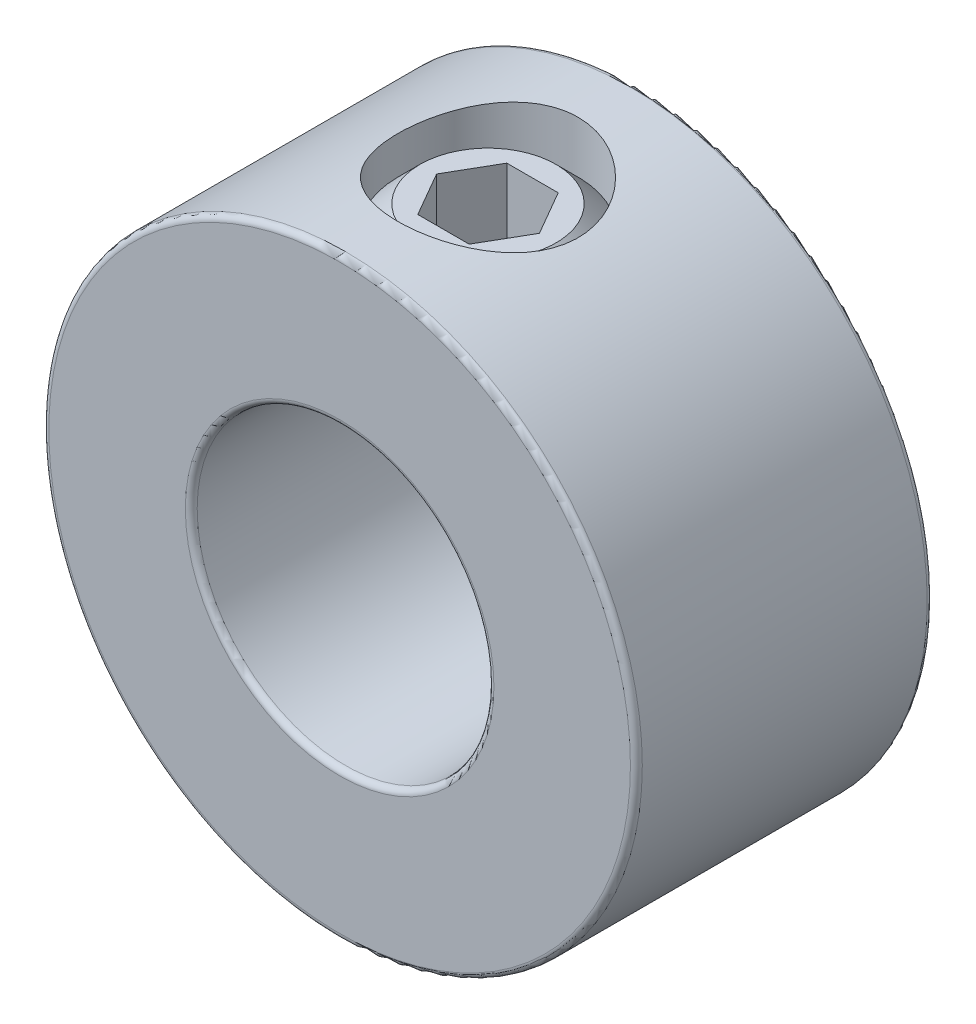
ISO-10303-21;
HEADER;
FILE_DESCRIPTION(('STEP AP214'),'2;1');
FILE_NAME('part.step','',(''),(''),'','','');
FILE_SCHEMA(('AUTOMOTIVE_DESIGN { 1 0 10303 214 1 1 1 1 }'));
ENDSEC;
DATA;
#1=APPLICATION_CONTEXT('core data for automotive mechanical design processes');
#2=APPLICATION_PROTOCOL_DEFINITION('international standard','automotive_design',2000,#1);
#3=PRODUCT_CONTEXT('',#1,'mechanical');
#4=PRODUCT('Part','Part','',(#3));
#5=PRODUCT_RELATED_PRODUCT_CATEGORY('part','',(#4));
#6=PRODUCT_DEFINITION_FORMATION('','',#4);
#7=PRODUCT_DEFINITION_CONTEXT('part definition',#1,'design');
#8=PRODUCT_DEFINITION('design','',#6,#7);
#9=PRODUCT_DEFINITION_SHAPE('','',#8);
#10=(LENGTH_UNIT() NAMED_UNIT(*) SI_UNIT(.MILLI.,.METRE.));
#11=(NAMED_UNIT(*) PLANE_ANGLE_UNIT() SI_UNIT($,.RADIAN.));
#12=(NAMED_UNIT(*) SI_UNIT($,.STERADIAN.) SOLID_ANGLE_UNIT());
#13=UNCERTAINTY_MEASURE_WITH_UNIT(LENGTH_MEASURE(1.E-05),#10,'distance_accuracy_value','');
#14=(GEOMETRIC_REPRESENTATION_CONTEXT(3) GLOBAL_UNCERTAINTY_ASSIGNED_CONTEXT((#13)) GLOBAL_UNIT_ASSIGNED_CONTEXT((#10,
#11,#12)) REPRESENTATION_CONTEXT('',''));
#15=CARTESIAN_POINT('',(0.,0.,0.));
#16=DIRECTION('',(0.,0.,1.));
#17=DIRECTION('',(1.,0.,0.));
#18=AXIS2_PLACEMENT_3D('',#15,#16,#17);
#19=CARTESIAN_POINT('',(0.,7.14375,0.));
#20=DIRECTION('',(0.,1.,0.));
#21=DIRECTION('',(-1.,0.,0.));
#22=AXIS2_PLACEMENT_3D('',#19,#20,#21);
#23=PLANE('',#22);
#24=CARTESIAN_POINT('',(0.,7.14375,0.));
#25=DIRECTION('',(0.,1.,0.));
#26=DIRECTION('',(-1.,0.,0.));
#27=AXIS2_PLACEMENT_3D('',#24,#25,#26);
#28=CIRCLE('',#27,1.81975161629017);
#29=CARTESIAN_POINT('',(-1.81975161629017,7.14375,0.));
#30=VERTEX_POINT('',#29);
#31=EDGE_CURVE('E12',#30,#30,#28,.T.);
#32=ORIENTED_EDGE('',*,*,#31,.T.);
#33=EDGE_LOOP('',(#32));
#34=FACE_BOUND('',#33,.T.);
#35=DIRECTION('',(1.,0.,0.));
#36=VECTOR('',#35,1.);
#37=CARTESIAN_POINT('',(-0.687407664253898,7.14374999999999,-1.190625));
#38=LINE('',#37,#36);
#39=CARTESIAN_POINT('',(-0.687407664253898,7.14374999999999,-1.190625));
#40=VERTEX_POINT('',#39);
#41=CARTESIAN_POINT('',(0.687407664253898,7.14375,-1.190625));
#42=VERTEX_POINT('',#41);
#43=EDGE_CURVE('E110',#40,#42,#38,.T.);
#44=ORIENTED_EDGE('',*,*,#43,.T.);
#45=DIRECTION('',(0.5,0.,0.866025403784439));
#46=VECTOR('',#45,1.);
#47=CARTESIAN_POINT('',(0.687407664253898,7.14374999999999,-1.190625));
#48=LINE('',#47,#46);
#49=CARTESIAN_POINT('',(1.3748153285078,7.14374999999999,0.));
#50=VERTEX_POINT('',#49);
#51=EDGE_CURVE('E56',#42,#50,#48,.T.);
#52=ORIENTED_EDGE('',*,*,#51,.T.);
#53=DIRECTION('',(-0.5,0.,0.866025403784439));
#54=VECTOR('',#53,1.);
#55=CARTESIAN_POINT('',(1.3748153285078,7.14374999999999,0.));
#56=LINE('',#55,#54);
#57=CARTESIAN_POINT('',(0.687407664253899,7.14374999999999,1.190625));
#58=VERTEX_POINT('',#57);
#59=EDGE_CURVE('E114',#50,#58,#56,.T.);
#60=ORIENTED_EDGE('',*,*,#59,.T.);
#61=DIRECTION('',(-1.,0.,0.));
#62=VECTOR('',#61,1.);
#63=CARTESIAN_POINT('',(0.687407664253899,7.14374999999999,1.190625));
#64=LINE('',#63,#62);
#65=CARTESIAN_POINT('',(-0.687407664253899,7.14374999999999,1.190625));
#66=VERTEX_POINT('',#65);
#67=EDGE_CURVE('E177',#58,#66,#64,.T.);
#68=ORIENTED_EDGE('',*,*,#67,.T.);
#69=DIRECTION('',(-0.5,0.,-0.866025403784439));
#70=VECTOR('',#69,1.);
#71=CARTESIAN_POINT('',(-0.687407664253899,7.14374999999999,1.190625));
#72=LINE('',#71,#70);
#73=CARTESIAN_POINT('',(-1.3748153285078,7.14374999999999,0.));
#74=VERTEX_POINT('',#73);
#75=EDGE_CURVE('E162',#66,#74,#72,.T.);
#76=ORIENTED_EDGE('',*,*,#75,.T.);
#77=DIRECTION('',(0.5,0.,-0.866025403784439));
#78=VECTOR('',#77,1.);
#79=CARTESIAN_POINT('',(-1.3748153285078,7.14374999999999,0.));
#80=LINE('',#79,#78);
#81=EDGE_CURVE('E158',#74,#40,#80,.T.);
#82=ORIENTED_EDGE('',*,*,#81,.T.);
#83=EDGE_LOOP('',(#44,#52,#60,#68,#76,#82));
#84=FACE_BOUND('',#83,.T.);
#85=ADVANCED_FACE('F42',(#34,#84),#23,.T.);
#86=CARTESIAN_POINT('',(0.,7.14375,0.));
#87=DIRECTION('',(0.,-1.,0.));
#88=DIRECTION('',(1.,0.,0.));
#89=AXIS2_PLACEMENT_3D('',#86,#87,#88);
#90=CONICAL_SURFACE('',#89,1.81975161629017,0.785398163397448);
#91=CARTESIAN_POINT('',(0.,6.55050161629017,0.));
#92=DIRECTION('',(0.,1.,0.));
#93=DIRECTION('',(-1.,0.,0.));
#94=AXIS2_PLACEMENT_3D('',#91,#92,#93);
#95=CIRCLE('',#94,2.413);
#96=CARTESIAN_POINT('',(-2.413,6.55050161629017,0.));
#97=VERTEX_POINT('',#96);
#98=EDGE_CURVE('E49',#97,#97,#95,.T.);
#99=ORIENTED_EDGE('',*,*,#98,.T.);
#100=EDGE_LOOP('',(#99));
#101=FACE_BOUND('',#100,.T.);
#102=ORIENTED_EDGE('',*,*,#31,.F.);
#103=EDGE_LOOP('',(#102));
#104=FACE_BOUND('',#103,.T.);
#105=ADVANCED_FACE('F132',(#101,#104),#90,.T.);
#106=CARTESIAN_POINT('',(0.,3.96875,0.));
#107=DIRECTION('',(0.,1.,0.));
#108=DIRECTION('',(-1.,0.,0.));
#109=AXIS2_PLACEMENT_3D('',#106,#107,#108);
#110=CYLINDRICAL_SURFACE('',#109,2.413);
#111=CARTESIAN_POINT('',(0.,4.56199838370983,0.));
#112=DIRECTION('',(0.,1.,0.));
#113=DIRECTION('',(-1.,0.,0.));
#114=AXIS2_PLACEMENT_3D('',#111,#112,#113);
#115=CIRCLE('',#114,2.413);
#116=CARTESIAN_POINT('',(-2.413,4.56199838370983,0.));
#117=VERTEX_POINT('',#116);
#118=EDGE_CURVE('E127',#117,#117,#115,.T.);
#119=ORIENTED_EDGE('',*,*,#118,.T.);
#120=EDGE_LOOP('',(#119));
#121=FACE_BOUND('',#120,.T.);
#122=ORIENTED_EDGE('',*,*,#98,.F.);
#123=EDGE_LOOP('',(#122));
#124=FACE_BOUND('',#123,.T.);
#125=ADVANCED_FACE('F135',(#121,#124),#110,.T.);
#126=CARTESIAN_POINT('',(0.,4.56199838370983,0.));
#127=DIRECTION('',(0.,1.,0.));
#128=DIRECTION('',(-1.,0.,0.));
#129=AXIS2_PLACEMENT_3D('',#126,#127,#128);
#130=CONICAL_SURFACE('',#129,2.413,0.785398163397448);
#131=CARTESIAN_POINT('',(0.,3.96875,0.));
#132=DIRECTION('',(0.,1.,0.));
#133=DIRECTION('',(-1.,0.,0.));
#134=AXIS2_PLACEMENT_3D('',#131,#132,#133);
#135=CIRCLE('',#134,1.81975161629017);
#136=CARTESIAN_POINT('',(-1.81975161629017,3.96875,0.));
#137=VERTEX_POINT('',#136);
#138=EDGE_CURVE('E119',#137,#137,#135,.T.);
#139=ORIENTED_EDGE('',*,*,#138,.T.);
#140=EDGE_LOOP('',(#139));
#141=FACE_BOUND('',#140,.T.);
#142=ORIENTED_EDGE('',*,*,#118,.F.);
#143=EDGE_LOOP('',(#142));
#144=FACE_BOUND('',#143,.T.);
#145=ADVANCED_FACE('F137',(#141,#144),#130,.T.);
#146=CARTESIAN_POINT('',(-1.81975161629017,3.96875,0.));
#147=DIRECTION('',(0.,-1.,0.));
#148=DIRECTION('',(1.,0.,0.));
#149=AXIS2_PLACEMENT_3D('',#146,#147,#148);
#150=PLANE('',#149);
#151=CARTESIAN_POINT('',(0.,3.96875,0.));
#152=DIRECTION('',(0.,1.,0.));
#153=DIRECTION('',(-1.,0.,0.));
#154=AXIS2_PLACEMENT_3D('',#151,#152,#153);
#155=CIRCLE('',#154,0.711898060451797);
#156=CARTESIAN_POINT('',(-0.711898060451796,3.96875,0.));
#157=VERTEX_POINT('',#156);
#158=EDGE_CURVE('E115',#157,#157,#155,.T.);
#159=ORIENTED_EDGE('',*,*,#158,.T.);
#160=EDGE_LOOP('',(#159));
#161=FACE_BOUND('',#160,.T.);
#162=ORIENTED_EDGE('',*,*,#138,.F.);
#163=EDGE_LOOP('',(#162));
#164=FACE_BOUND('',#163,.T.);
#165=ADVANCED_FACE('F144',(#161,#164),#150,.T.);
#166=CARTESIAN_POINT('',(0.,3.96875,0.));
#167=DIRECTION('',(0.,-1.,0.));
#168=DIRECTION('',(1.,0.,0.));
#169=AXIS2_PLACEMENT_3D('',#166,#167,#168);
#170=CONICAL_SURFACE('',#169,0.711898060451797,0.785398163397448);
#171=CARTESIAN_POINT('',(0.,4.6806480604518,0.));
#172=VERTEX_POINT('',#171);
#173=VERTEX_LOOP('',#172);
#174=FACE_BOUND('',#173,.T.);
#175=ORIENTED_EDGE('',*,*,#158,.F.);
#176=EDGE_LOOP('',(#175));
#177=FACE_BOUND('',#176,.T.);
#178=ADVANCED_FACE('F211',(#174,#177),#170,.F.);
#179=CARTESIAN_POINT('',(0.687407664253898,4.76249999999999,-1.190625));
#180=DIRECTION('',(-0.866025403784439,0.,0.5));
#181=DIRECTION('',(0.5,0.,0.866025403784438));
#182=AXIS2_PLACEMENT_3D('',#179,#180,#181);
#183=PLANE('',#182);
#184=ORIENTED_EDGE('',*,*,#51,.F.);
#185=DIRECTION('',(0.,1.,0.));
#186=VECTOR('',#185,1.);
#187=CARTESIAN_POINT('',(0.687407664253898,4.76249999999999,-1.190625));
#188=LINE('',#187,#186);
#189=CARTESIAN_POINT('',(0.687407664253898,4.76249999999999,-1.190625));
#190=VERTEX_POINT('',#189);
#191=EDGE_CURVE('E109',#190,#42,#188,.T.);
#192=ORIENTED_EDGE('',*,*,#191,.F.);
#193=DIRECTION('',(0.5,0.,0.866025403784439));
#194=VECTOR('',#193,1.);
#195=CARTESIAN_POINT('',(0.687407664253898,4.76249999999999,-1.190625));
#196=LINE('',#195,#194);
#197=CARTESIAN_POINT('',(1.3748153285078,4.76249999999999,0.));
#198=VERTEX_POINT('',#197);
#199=EDGE_CURVE('E100',#190,#198,#196,.T.);
#200=ORIENTED_EDGE('',*,*,#199,.T.);
#201=DIRECTION('',(0.,1.,0.));
#202=VECTOR('',#201,1.);
#203=CARTESIAN_POINT('',(1.3748153285078,4.76249999999999,0.));
#204=LINE('',#203,#202);
#205=EDGE_CURVE('E108',#198,#50,#204,.T.);
#206=ORIENTED_EDGE('',*,*,#205,.T.);
#207=EDGE_LOOP('',(#184,#192,#200,#206));
#208=FACE_BOUND('',#207,.T.);
#209=ADVANCED_FACE('F107',(#208),#183,.T.);
#210=CARTESIAN_POINT('',(1.3748153285078,4.76249999999999,0.));
#211=DIRECTION('',(-0.866025403784439,0.,-0.5));
#212=DIRECTION('',(-0.5,0.,0.866025403784439));
#213=AXIS2_PLACEMENT_3D('',#210,#211,#212);
#214=PLANE('',#213);
#215=ORIENTED_EDGE('',*,*,#59,.F.);
#216=ORIENTED_EDGE('',*,*,#205,.F.);
#217=DIRECTION('',(-0.5,0.,0.866025403784439));
#218=VECTOR('',#217,1.);
#219=CARTESIAN_POINT('',(1.3748153285078,4.76249999999999,0.));
#220=LINE('',#219,#218);
#221=CARTESIAN_POINT('',(0.687407664253899,4.76249999999999,1.190625));
#222=VERTEX_POINT('',#221);
#223=EDGE_CURVE('E96',#198,#222,#220,.T.);
#224=ORIENTED_EDGE('',*,*,#223,.T.);
#225=DIRECTION('',(0.,1.,0.));
#226=VECTOR('',#225,1.);
#227=CARTESIAN_POINT('',(0.687407664253899,4.76249999999999,1.190625));
#228=LINE('',#227,#226);
#229=EDGE_CURVE('E116',#222,#58,#228,.T.);
#230=ORIENTED_EDGE('',*,*,#229,.T.);
#231=EDGE_LOOP('',(#215,#216,#224,#230));
#232=FACE_BOUND('',#231,.T.);
#233=ADVANCED_FACE('F112',(#232),#214,.T.);
#234=CARTESIAN_POINT('',(0.687407664253899,4.76249999999999,1.190625));
#235=DIRECTION('',(0.,0.,-1.));
#236=DIRECTION('',(-1.,0.,0.));
#237=AXIS2_PLACEMENT_3D('',#234,#235,#236);
#238=PLANE('',#237);
#239=ORIENTED_EDGE('',*,*,#67,.F.);
#240=ORIENTED_EDGE('',*,*,#229,.F.);
#241=DIRECTION('',(-1.,0.,0.));
#242=VECTOR('',#241,1.);
#243=CARTESIAN_POINT('',(0.687407664253899,4.76249999999999,1.190625));
#244=LINE('',#243,#242);
#245=CARTESIAN_POINT('',(-0.687407664253899,4.76249999999999,1.190625));
#246=VERTEX_POINT('',#245);
#247=EDGE_CURVE('E102',#222,#246,#244,.T.);
#248=ORIENTED_EDGE('',*,*,#247,.T.);
#249=DIRECTION('',(0.,1.,0.));
#250=VECTOR('',#249,1.);
#251=CARTESIAN_POINT('',(-0.687407664253899,4.76249999999999,1.190625));
#252=LINE('',#251,#250);
#253=EDGE_CURVE('E121',#246,#66,#252,.T.);
#254=ORIENTED_EDGE('',*,*,#253,.T.);
#255=EDGE_LOOP('',(#239,#240,#248,#254));
#256=FACE_BOUND('',#255,.T.);
#257=ADVANCED_FACE('F175',(#256),#238,.T.);
#258=CARTESIAN_POINT('',(-0.687407664253899,4.76249999999999,1.190625));
#259=DIRECTION('',(0.866025403784439,0.,-0.5));
#260=DIRECTION('',(-0.5,0.,-0.866025403784439));
#261=AXIS2_PLACEMENT_3D('',#258,#259,#260);
#262=PLANE('',#261);
#263=ORIENTED_EDGE('',*,*,#75,.F.);
#264=ORIENTED_EDGE('',*,*,#253,.F.);
#265=DIRECTION('',(-0.5,0.,-0.866025403784439));
#266=VECTOR('',#265,1.);
#267=CARTESIAN_POINT('',(-0.687407664253899,4.76249999999999,1.190625));
#268=LINE('',#267,#266);
#269=CARTESIAN_POINT('',(-1.3748153285078,4.76249999999999,0.));
#270=VERTEX_POINT('',#269);
#271=EDGE_CURVE('E188',#246,#270,#268,.T.);
#272=ORIENTED_EDGE('',*,*,#271,.T.);
#273=DIRECTION('',(0.,1.,0.));
#274=VECTOR('',#273,1.);
#275=CARTESIAN_POINT('',(-1.3748153285078,4.76249999999999,0.));
#276=LINE('',#275,#274);
#277=EDGE_CURVE('E170',#270,#74,#276,.T.);
#278=ORIENTED_EDGE('',*,*,#277,.T.);
#279=EDGE_LOOP('',(#263,#264,#272,#278));
#280=FACE_BOUND('',#279,.T.);
#281=ADVANCED_FACE('F179',(#280),#262,.T.);
#282=CARTESIAN_POINT('',(-1.3748153285078,4.76249999999999,0.));
#283=DIRECTION('',(0.866025403784439,0.,0.5));
#284=DIRECTION('',(0.5,0.,-0.866025403784439));
#285=AXIS2_PLACEMENT_3D('',#282,#283,#284);
#286=PLANE('',#285);
#287=ORIENTED_EDGE('',*,*,#81,.F.);
#288=ORIENTED_EDGE('',*,*,#277,.F.);
#289=DIRECTION('',(0.5,0.,-0.866025403784439));
#290=VECTOR('',#289,1.);
#291=CARTESIAN_POINT('',(-1.3748153285078,4.76249999999999,0.));
#292=LINE('',#291,#290);
#293=CARTESIAN_POINT('',(-0.687407664253898,4.76249999999999,-1.190625));
#294=VERTEX_POINT('',#293);
#295=EDGE_CURVE('E186',#270,#294,#292,.T.);
#296=ORIENTED_EDGE('',*,*,#295,.T.);
#297=DIRECTION('',(0.,1.,0.));
#298=VECTOR('',#297,1.);
#299=CARTESIAN_POINT('',(-0.687407664253898,4.76249999999999,-1.190625));
#300=LINE('',#299,#298);
#301=EDGE_CURVE('E167',#294,#40,#300,.T.);
#302=ORIENTED_EDGE('',*,*,#301,.T.);
#303=EDGE_LOOP('',(#287,#288,#296,#302));
#304=FACE_BOUND('',#303,.T.);
#305=ADVANCED_FACE('F192',(#304),#286,.T.);
#306=CARTESIAN_POINT('',(-0.687407664253898,4.76249999999999,-1.190625));
#307=DIRECTION('',(0.,0.,1.));
#308=DIRECTION('',(1.,0.,0.));
#309=AXIS2_PLACEMENT_3D('',#306,#307,#308);
#310=PLANE('',#309);
#311=ORIENTED_EDGE('',*,*,#43,.F.);
#312=ORIENTED_EDGE('',*,*,#301,.F.);
#313=DIRECTION('',(1.,0.,0.));
#314=VECTOR('',#313,1.);
#315=CARTESIAN_POINT('',(-0.687407664253898,4.76249999999999,-1.190625));
#316=LINE('',#315,#314);
#317=EDGE_CURVE('E168',#294,#190,#316,.T.);
#318=ORIENTED_EDGE('',*,*,#317,.T.);
#319=ORIENTED_EDGE('',*,*,#191,.T.);
#320=EDGE_LOOP('',(#311,#312,#318,#319));
#321=FACE_BOUND('',#320,.T.);
#322=ADVANCED_FACE('F193',(#321),#310,.T.);
#323=CARTESIAN_POINT('',(0.687407664253898,4.76249999999999,-1.190625));
#324=DIRECTION('',(0.,1.,0.));
#325=DIRECTION('',(0.,0.,1.));
#326=AXIS2_PLACEMENT_3D('',#323,#324,#325);
#327=PLANE('',#326);
#328=ORIENTED_EDGE('',*,*,#199,.F.);
#329=ORIENTED_EDGE('',*,*,#317,.F.);
#330=ORIENTED_EDGE('',*,*,#295,.F.);
#331=ORIENTED_EDGE('',*,*,#271,.F.);
#332=ORIENTED_EDGE('',*,*,#247,.F.);
#333=ORIENTED_EDGE('',*,*,#223,.F.);
#334=EDGE_LOOP('',(#328,#329,#330,#331,#332,#333));
#335=FACE_BOUND('',#334,.T.);
#336=ADVANCED_FACE('F98',(#335),#327,.T.);
#337=CLOSED_SHELL('',(#85,#105,#125,#145,#165,#178,#209,#233,#257,#281,#305,#322,#336));
#338=MANIFOLD_SOLID_BREP('B2',#337);
#339=CARTESIAN_POINT('',(0.,0.,3.96875));
#340=DIRECTION('',(0.,0.,1.));
#341=DIRECTION('',(1.,0.,0.));
#342=AXIS2_PLACEMENT_3D('',#339,#340,#341);
#343=PLANE('',#342);
#344=CARTESIAN_POINT('',(0.,0.,3.96875));
#345=DIRECTION('',(0.,0.,1.));
#346=DIRECTION('',(1.,0.,0.));
#347=AXIS2_PLACEMENT_3D('',#344,#345,#346);
#348=CIRCLE('',#347,4.1275);
#349=CARTESIAN_POINT('',(4.1275,0.,3.96875));
#350=VERTEX_POINT('',#349);
#351=EDGE_CURVE('E307',#350,#350,#348,.F.);
#352=ORIENTED_EDGE('',*,*,#351,.T.);
#353=EDGE_LOOP('',(#352));
#354=FACE_BOUND('',#353,.T.);
#355=CARTESIAN_POINT('',(0.,0.,3.96875));
#356=DIRECTION('',(0.,0.,1.));
#357=DIRECTION('',(1.,0.,0.));
#358=AXIS2_PLACEMENT_3D('',#355,#356,#357);
#359=CIRCLE('',#358,7.77875);
#360=CARTESIAN_POINT('',(7.77875,0.,3.96875));
#361=VERTEX_POINT('',#360);
#362=EDGE_CURVE('E311',#361,#361,#359,.T.);
#363=ORIENTED_EDGE('',*,*,#362,.T.);
#364=EDGE_LOOP('',(#363));
#365=FACE_BOUND('',#364,.T.);
#366=ADVANCED_FACE('F296',(#354,#365),#343,.T.);
#367=CARTESIAN_POINT('',(0.,0.,-3.96875));
#368=DIRECTION('',(0.,0.,1.));
#369=DIRECTION('',(1.,0.,0.));
#370=AXIS2_PLACEMENT_3D('',#367,#368,#369);
#371=PLANE('',#370);
#372=CARTESIAN_POINT('',(0.,0.,-3.96875));
#373=DIRECTION('',(0.,0.,1.));
#374=DIRECTION('',(1.,0.,0.));
#375=AXIS2_PLACEMENT_3D('',#372,#373,#374);
#376=CIRCLE('',#375,4.1275);
#377=CARTESIAN_POINT('',(4.1275,0.,-3.96875));
#378=VERTEX_POINT('',#377);
#379=EDGE_CURVE('E322',#378,#378,#376,.T.);
#380=ORIENTED_EDGE('',*,*,#379,.T.);
#381=EDGE_LOOP('',(#380));
#382=FACE_BOUND('',#381,.T.);
#383=CARTESIAN_POINT('',(0.,0.,-3.96875));
#384=DIRECTION('',(0.,0.,1.));
#385=DIRECTION('',(1.,0.,0.));
#386=AXIS2_PLACEMENT_3D('',#383,#384,#385);
#387=CIRCLE('',#386,7.77875);
#388=CARTESIAN_POINT('',(7.77875,0.,-3.96875));
#389=VERTEX_POINT('',#388);
#390=EDGE_CURVE('E325',#389,#389,#387,.F.);
#391=ORIENTED_EDGE('',*,*,#390,.T.);
#392=EDGE_LOOP('',(#391));
#393=FACE_BOUND('',#392,.T.);
#394=ADVANCED_FACE('F359',(#382,#393),#371,.F.);
#395=CARTESIAN_POINT('',(0.,0.,3.96875));
#396=DIRECTION('',(0.,0.,-1.));
#397=DIRECTION('',(-1.,0.,0.));
#398=AXIS2_PLACEMENT_3D('',#395,#396,#397);
#399=CYLINDRICAL_SURFACE('',#398,7.9375);
#400=CARTESIAN_POINT('',(0.,0.,-3.81));
#401=DIRECTION('',(0.,0.,1.));
#402=DIRECTION('',(1.,0.,0.));
#403=AXIS2_PLACEMENT_3D('',#400,#401,#402);
#404=CIRCLE('',#403,7.9375);
#405=CARTESIAN_POINT('',(7.9375,0.,-3.81));
#406=VERTEX_POINT('',#405);
#407=EDGE_CURVE('E41',#406,#406,#404,.T.);
#408=ORIENTED_EDGE('',*,*,#407,.T.);
#409=EDGE_LOOP('',(#408));
#410=FACE_BOUND('',#409,.T.);
#411=CARTESIAN_POINT('',(0.,0.,3.81));
#412=DIRECTION('',(0.,0.,1.));
#413=DIRECTION('',(1.,0.,0.));
#414=AXIS2_PLACEMENT_3D('',#411,#412,#413);
#415=CIRCLE('',#414,7.9375);
#416=CARTESIAN_POINT('',(7.9375,0.,3.81));
#417=VERTEX_POINT('',#416);
#418=EDGE_CURVE('E303',#417,#417,#415,.F.);
#419=ORIENTED_EDGE('',*,*,#418,.T.);
#420=EDGE_LOOP('',(#419));
#421=FACE_BOUND('',#420,.T.);
#422=CARTESIAN_POINT('',(0.,7.9375,-2.413));
#423=CARTESIAN_POINT('',(0.132292774899317,7.9374990050537,-2.41299862237628));
#424=CARTESIAN_POINT('',(0.264599518381689,7.93416116207132,-2.40208456794969));
#425=CARTESIAN_POINT('',(0.525354946013904,7.92117222946042,-2.35882374345716));
#426=CARTESIAN_POINT('',(0.653802557415082,7.91151940108894,-2.32647107053551));
#427=CARTESIAN_POINT('',(0.903041313331836,7.88695717599938,-2.24151680045489));
#428=CARTESIAN_POINT('',(1.0238436159252,7.87205565851205,-2.18894554423122));
#429=CARTESIAN_POINT('',(1.25491860814633,7.83854164816898,-2.06517231127943));
#430=CARTESIAN_POINT('',(1.36518981088764,7.81992863242886,-1.99396770900084));
#431=CARTESIAN_POINT('',(1.5753146010731,7.78036198161428,-1.83274390297987));
#432=CARTESIAN_POINT('',(1.67481494525514,7.75935941289957,-1.74227635763322));
#433=CARTESIAN_POINT('',(1.85749109856336,7.71766998618262,-1.54604996654896));
#434=CARTESIAN_POINT('',(1.9406640704021,7.69698318362761,-1.44028846864199));
#435=CARTESIAN_POINT('',(2.09020118290126,7.65774749745578,-1.21346560478497));
#436=CARTESIAN_POINT('',(2.15613096597831,7.63925929192144,-1.09210639523313));
#437=CARTESIAN_POINT('',(2.26650098404084,7.60724691943917,-0.839370407786386));
#438=CARTESIAN_POINT('',(2.31094653649145,7.59372152436824,-0.707996118007792));
#439=CARTESIAN_POINT('',(2.3758067264602,7.57367670858706,-0.442932068104457));
#440=CARTESIAN_POINT('',(2.39687388308448,7.56696751920921,-0.309416717357086));
#441=CARTESIAN_POINT('',(2.4164171516007,7.56075056418472,-0.0405910256843933));
#442=CARTESIAN_POINT('',(2.41489890338842,7.56124100068904,0.0947188586885998));
#443=CARTESIAN_POINT('',(2.38982629949606,7.56919991114954,0.357957705592921));
#444=CARTESIAN_POINT('',(2.36709319986061,7.57640830969674,0.485974062421038));
#445=CARTESIAN_POINT('',(2.30156455882043,7.59656963695107,0.736282348204517));
#446=CARTESIAN_POINT('',(2.25876698945115,7.60952314632332,0.858573697144985));
#447=CARTESIAN_POINT('',(2.15372728275048,7.63992010283533,1.09595275882303));
#448=CARTESIAN_POINT('',(2.09122148030352,7.65742383164637,1.21091575085397));
#449=CARTESIAN_POINT('',(1.94872282727374,7.6949204514905,1.42899447413862));
#450=CARTESIAN_POINT('',(1.86872564146393,7.71491395908373,1.53210725864378));
#451=CARTESIAN_POINT('',(1.68945173313376,7.75618852856768,1.72821183511834));
#452=CARTESIAN_POINT('',(1.58949459558667,7.77748801126888,1.82057882521009));
#453=CARTESIAN_POINT('',(1.37524410592773,7.81821490430143,1.98738656746316));
#454=CARTESIAN_POINT('',(1.26094980324712,7.83764219035306,2.0618261300612));
#455=CARTESIAN_POINT('',(1.0201121910355,7.87262138541946,2.19105912538642));
#456=CARTESIAN_POINT('',(0.893488365352983,7.88814506930487,2.24571066163077));
#457=CARTESIAN_POINT('',(0.632264385940609,7.91336446499524,2.3327557354663));
#458=CARTESIAN_POINT('',(0.497666531143089,7.92306184764078,2.36515565465833));
#459=CARTESIAN_POINT('',(0.229624252219485,7.93527028493288,2.40572996828062));
#460=CARTESIAN_POINT('',(0.09631920362542,7.93803232635549,2.41475084587308));
#461=CARTESIAN_POINT('',(-0.169910326320387,7.93679710103237,2.41068803034094));
#462=CARTESIAN_POINT('',(-0.30283485746222,7.93280076329333,2.39760737529289));
#463=CARTESIAN_POINT('',(-0.561313045757695,7.918662317796,2.35039574306306));
#464=CARTESIAN_POINT('',(-0.686966276089901,7.9086655503028,2.31676225166702));
#465=CARTESIAN_POINT('',(-0.930816403381333,7.88368716256098,2.23000090507394));
#466=CARTESIAN_POINT('',(-1.04901239362654,7.86870493752267,2.17687068463324));
#467=CARTESIAN_POINT('',(-1.27768494619444,7.83486511139573,2.05122165093958));
#468=CARTESIAN_POINT('',(-1.38791430468818,7.81592458790179,1.97827588105506));
#469=CARTESIAN_POINT('',(-1.59485450866657,7.77634000763052,1.81558313194289));
#470=CARTESIAN_POINT('',(-1.69156186567424,7.75569551343041,1.72583183105413));
#471=CARTESIAN_POINT('',(-1.87245924486539,7.71406179196385,1.52809707336634));
#472=CARTESIAN_POINT('',(-1.95604664764415,7.69308849985636,1.41955774085528));
#473=CARTESIAN_POINT('',(-2.10386717742399,7.65398694583366,1.18953707022205));
#474=CARTESIAN_POINT('',(-2.16810075387635,7.63585861785491,1.06805603273204));
#475=CARTESIAN_POINT('',(-2.27496230406853,7.6047061861998,0.815946913466264));
#476=CARTESIAN_POINT('',(-2.31768600255476,7.59165952754718,0.685362356123388));
#477=CARTESIAN_POINT('',(-2.38040189821885,7.57223163077592,0.418379500826614));
#478=CARTESIAN_POINT('',(-2.40040215315239,7.56584802999566,0.281983281505183));
#479=CARTESIAN_POINT('',(-2.41654573186451,7.56070606206809,0.0135215462387282));
#480=CARTESIAN_POINT('',(-2.41367335403041,7.56163307372804,-0.11847951451985));
#481=CARTESIAN_POINT('',(-2.38651114002636,7.57024895804181,-0.380023066349805));
#482=CARTESIAN_POINT('',(-2.36222220501566,7.57793754618407,-0.509565660633487));
#483=CARTESIAN_POINT('',(-2.29355931064324,7.5989964058365,-0.76085836843846));
#484=CARTESIAN_POINT('',(-2.24945261375918,7.61229093341087,-0.882688328499914));
#485=CARTESIAN_POINT('',(-2.14261496851981,7.64304804543904,-1.11731626044873));
#486=CARTESIAN_POINT('',(-2.07988038265957,7.66051144382583,-1.23011246282902));
#487=CARTESIAN_POINT('',(-1.93482964223909,7.69845124150092,-1.44802165282358));
#488=CARTESIAN_POINT('',(-1.85187057120019,7.71901570680081,-1.55269133387613));
#489=CARTESIAN_POINT('',(-1.66987475949574,7.76042016207134,-1.74694286232239));
#490=CARTESIAN_POINT('',(-1.57083380768261,7.78126022289201,-1.83652074527573));
#491=CARTESIAN_POINT('',(-1.35587248164352,7.82162492221923,-2.00075462812685));
#492=CARTESIAN_POINT('',(-1.239531599163,7.84109057268621,-2.07487627262594));
#493=CARTESIAN_POINT('',(-0.995447775442171,7.87579500420969,-2.20240594981202));
#494=CARTESIAN_POINT('',(-0.867709932888345,7.89103566300204,-2.25582318848638));
#495=CARTESIAN_POINT('',(-0.617657643652073,7.91432673031083,-2.33592468921693));
#496=CARTESIAN_POINT('',(-0.496078219783341,7.92294375396858,-2.364748063768));
#497=CARTESIAN_POINT('',(-0.249669622610166,7.93453035635686,-2.40328467078255));
#498=CARTESIAN_POINT('',(-0.12484103093866,7.93750093890329,-2.41300130002538));
#499=CARTESIAN_POINT('',(0.,7.9375,-2.413));
#500=B_SPLINE_CURVE_WITH_KNOTS('',3,(#422,#423,#424,#425,#426,#427,#428,#429,#430,#431,#432,
#433,#434,#435,#436,#437,#438,#439,#440,#441,#442,#443,#444,#445,#446,#447,#448,#449,#450,#451,
#452,#453,#454,#455,#456,#457,#458,#459,#460,#461,#462,#463,#464,#465,#466,#467,#468,#469,#470,
#471,#472,#473,#474,#475,#476,#477,#478,#479,#480,#481,#482,#483,#484,#485,#486,#487,#488,#489,
#490,#491,#492,#493,#494,#495,#496,#497,#498,#499),.UNSPECIFIED.,.T.,.F.,(4,2,2,2,2,2,2,2,2,2,2,
2,2,2,2,2,2,2,2,2,2,2,2,2,2,2,2,2,2,2,2,2,2,2,2,2,2,2,4),(0.,0.396419658797233,
0.792948512171322,1.18888462342481,1.5848765545249,1.99135590349126,2.39790582595712,
2.81388034303934,3.22975185135954,3.63369866570383,4.03754461049548,4.42637821024115,
4.81525111881571,5.20956461414611,5.60397595080319,6.01532502722272,6.42670139093795,
6.84097182422919,7.25512339812399,7.65405578815865,8.0529333454106,8.44251867756104,
8.83215128784881,9.230955625767,9.62986266023801,10.0436726713234,10.4574730718142,
10.8694153009928,11.2812114094117,11.6753852663269,12.0695425381084,12.4585367217993,
12.8476069151672,13.2511843609796,13.6548676571655,14.0707821958696,14.486511589997,
14.8606683757548,15.2347586382522),.UNSPECIFIED.);
#501=CARTESIAN_POINT('',(0.,7.9375,-2.413));
#502=VERTEX_POINT('',#501);
#503=EDGE_CURVE('E328',#502,#502,#500,.T.);
#504=ORIENTED_EDGE('',*,*,#503,.T.);
#505=EDGE_LOOP('',(#504));
#506=FACE_BOUND('',#505,.T.);
#507=ADVANCED_FACE('F355',(#410,#421,#506),#399,.T.);
#508=CARTESIAN_POINT('',(0.,0.,3.96875));
#509=DIRECTION('',(0.,0.,-1.));
#510=DIRECTION('',(-1.,0.,0.));
#511=AXIS2_PLACEMENT_3D('',#508,#509,#510);
#512=CYLINDRICAL_SURFACE('',#511,3.96875);
#513=CARTESIAN_POINT('',(0.,0.,-3.81));
#514=DIRECTION('',(0.,0.,1.));
#515=DIRECTION('',(1.,0.,0.));
#516=AXIS2_PLACEMENT_3D('',#513,#514,#515);
#517=CIRCLE('',#516,3.96875);
#518=CARTESIAN_POINT('',(3.96875,0.,-3.81));
#519=VERTEX_POINT('',#518);
#520=EDGE_CURVE('E316',#519,#519,#517,.F.);
#521=ORIENTED_EDGE('',*,*,#520,.T.);
#522=EDGE_LOOP('',(#521));
#523=FACE_BOUND('',#522,.T.);
#524=CARTESIAN_POINT('',(0.,0.,3.81));
#525=DIRECTION('',(0.,0.,1.));
#526=DIRECTION('',(1.,0.,0.));
#527=AXIS2_PLACEMENT_3D('',#524,#525,#526);
#528=CIRCLE('',#527,3.96875);
#529=CARTESIAN_POINT('',(3.96875,0.,3.81));
#530=VERTEX_POINT('',#529);
#531=EDGE_CURVE('E319',#530,#530,#528,.T.);
#532=ORIENTED_EDGE('',*,*,#531,.T.);
#533=EDGE_LOOP('',(#532));
#534=FACE_BOUND('',#533,.T.);
#535=CARTESIAN_POINT('',(0.,3.96875,-2.413));
#536=CARTESIAN_POINT('',(0.123165501550284,3.96874204339669,-2.41299124615945));
#537=CARTESIAN_POINT('',(0.246516738261875,3.96295429853951,-2.40350384959746));
#538=CARTESIAN_POINT('',(0.489483664080046,3.94034943987807,-2.36604326559291));
#539=CARTESIAN_POINT('',(0.609090127783646,3.92350703743669,-2.33802769196767));
#540=CARTESIAN_POINT('',(0.840546582386573,3.88049577993341,-2.26510491179092));
#541=CARTESIAN_POINT('',(0.952431828991632,3.8543732029897,-2.22028146179405));
#542=CARTESIAN_POINT('',(1.16673008430404,3.79500971512363,-2.11554934419897));
#543=CARTESIAN_POINT('',(1.26914501361637,3.76177025207777,-2.05564374451438));
#544=CARTESIAN_POINT('',(1.47058753111351,3.687916691379,-1.91729289743173));
#545=CARTESIAN_POINT('',(1.56873586524913,3.64693051913672,-1.83776986476495));
#546=CARTESIAN_POINT('',(1.75115925298086,3.56293790693084,-1.66488233877126));
#547=CARTESIAN_POINT('',(1.83541593933604,3.51992888739431,-1.57149982566307));
#548=CARTESIAN_POINT('',(1.99850147891552,3.43025832872789,-1.35964489661003));
#549=CARTESIAN_POINT('',(2.07529106286855,3.38382416372775,-1.23949270263077));
#550=CARTESIAN_POINT('',(2.20731894277433,3.29922586533873,-0.985260717608268));
#551=CARTESIAN_POINT('',(2.26259272815675,3.26104815989316,-0.851204327616272));
#552=CARTESIAN_POINT('',(2.33806142410285,3.2071858977595,-0.606725086153752));
#553=CARTESIAN_POINT('',(2.3635499927685,3.18827407496012,-0.498650940719577));
#554=CARTESIAN_POINT('',(2.3994244997262,3.16137002399118,-0.27874861563771));
#555=CARTESIAN_POINT('',(2.40983000472769,3.15336364939586,-0.166925492537775));
#556=CARTESIAN_POINT('',(2.41493016649177,3.14946076169536,0.0575392620475352));
#557=CARTESIAN_POINT('',(2.40959091684864,3.15359038345178,0.170182138134826));
#558=CARTESIAN_POINT('',(2.3834758297023,3.17336918561413,0.392656374086385));
#559=CARTESIAN_POINT('',(2.36268812164138,3.18902722434164,0.502485504705744));
#560=CARTESIAN_POINT('',(2.3072582560278,3.22934546748502,0.714839170566954));
#561=CARTESIAN_POINT('',(2.27284136966713,3.2538587555979,0.817452012053584));
#562=CARTESIAN_POINT('',(2.19144263462213,3.30922547315599,1.01569946550598));
#563=CARTESIAN_POINT('',(2.14445623611994,3.34008119745013,1.11133153463737));
#564=CARTESIAN_POINT('',(2.02958239720278,3.41132068401533,1.31107139668459));
#565=CARTESIAN_POINT('',(1.95946010965428,3.45242166708182,1.41363816272798));
#566=CARTESIAN_POINT('',(1.8046098923845,3.53583156997046,1.60663550750143));
#567=CARTESIAN_POINT('',(1.71986762893658,3.57814164091738,1.69705401960805));
#568=CARTESIAN_POINT('',(1.52341346023064,3.66652895599888,1.87670279125692));
#569=CARTESIAN_POINT('',(1.40956777558015,3.71224383147173,1.96379855427126));
#570=CARTESIAN_POINT('',(1.16600981934112,3.79577231057004,2.11746058126192));
#571=CARTESIAN_POINT('',(1.03630546031566,3.83358982922035,2.18403702528473));
#572=CARTESIAN_POINT('',(0.836657404029858,3.88011810238804,2.26436147855773));
#573=CARTESIAN_POINT('',(0.771445792482796,3.89363655503471,2.28741378555035));
#574=CARTESIAN_POINT('',(0.63877705404067,3.91758471873137,2.3279461715394));
#575=CARTESIAN_POINT('',(0.571321220958915,3.92801617627651,2.34542940172032));
#576=CARTESIAN_POINT('',(0.434774063004328,3.94546326769465,2.37453334076451));
#577=CARTESIAN_POINT('',(0.36568406213146,3.95248157377129,2.38615863614474));
#578=CARTESIAN_POINT('',(0.226511162532038,3.96289656392044,2.40336960926214));
#579=CARTESIAN_POINT('',(0.156428414099685,3.966293790382,2.40895619151915));
#580=CARTESIAN_POINT('',(-0.0345875094638976,3.97042803093639,2.41576593447406));
#581=CARTESIAN_POINT('',(-0.155889645087031,3.96750179775886,2.41097308037977));
#582=CARTESIAN_POINT('',(-0.395580786800256,3.95081788580082,2.38341492656171));
#583=CARTESIAN_POINT('',(-0.513969891060856,3.93706057254972,2.36065023335502));
#584=CARTESIAN_POINT('',(-0.741302925101665,3.9005543203932,2.29924007500009));
#585=CARTESIAN_POINT('',(-0.850420645087186,3.87807562396895,2.26107063451517));
#586=CARTESIAN_POINT('',(-1.06064649564909,3.82593168660241,2.17041877534692));
#587=CARTESIAN_POINT('',(-1.16175312592156,3.79626510372601,2.11793368378936));
#588=CARTESIAN_POINT('',(-1.36438293166863,3.72853735621207,1.99412771667006));
#589=CARTESIAN_POINT('',(-1.46487371909966,3.68992598646786,1.92142252874577));
#590=CARTESIAN_POINT('',(-1.6529744799132,3.60958967643982,1.76223036727608));
#591=CARTESIAN_POINT('',(-1.74056936405613,3.56786117353918,1.67572749194951));
#592=CARTESIAN_POINT('',(-1.91261918342017,3.4790009867155,1.47780510411286));
#593=CARTESIAN_POINT('',(-1.99504642611132,3.43190199283522,1.3645979373042));
#594=CARTESIAN_POINT('',(-2.13985097603664,3.34353376432047,1.12395576920229));
#595=CARTESIAN_POINT('',(-2.20224731258024,3.3022590176874,0.99653442736945));
#596=CARTESIAN_POINT('',(-2.29344177866512,3.23936579282098,0.758458757219687));
#597=CARTESIAN_POINT('',(-2.32657866306329,3.2154293082859,0.65008626694079));
#598=CARTESIAN_POINT('',(-2.37744086245656,3.17801315216161,0.428095724280517));
#599=CARTESIAN_POINT('',(-2.39518851540099,3.16451832725394,0.314485527906917));
#600=CARTESIAN_POINT('',(-2.4142849438641,3.14997859909978,0.0845648471209729));
#601=CARTESIAN_POINT('',(-2.41556252659962,3.14898774534438,-0.0317551842091482));
#602=CARTESIAN_POINT('',(-2.40143983741951,3.15976763622633,-0.262802510402487));
#603=CARTESIAN_POINT('',(-2.38603134047097,3.17154467451613,-0.377528991515132));
#604=CARTESIAN_POINT('',(-2.34087808899904,3.20499353082565,-0.595427565837474));
#605=CARTESIAN_POINT('',(-2.31201651153951,3.22605194545112,-0.698883891062723));
#606=CARTESIAN_POINT('',(-2.24159346468759,3.27537424028443,-0.899525378863215));
#607=CARTESIAN_POINT('',(-2.20002713060506,3.30364087985553,-0.996708121970213));
#608=CARTESIAN_POINT('',(-2.09815316530071,3.36941108076951,-1.19787071136103));
#609=CARTESIAN_POINT('',(-2.03595940923333,3.40766534627249,-1.30064658521609));
#610=CARTESIAN_POINT('',(-1.89759243380594,3.48661316283012,-1.49532299960668));
#611=CARTESIAN_POINT('',(-1.8214076316638,3.52730871602022,-1.58721442476447));
#612=CARTESIAN_POINT('',(-1.64167102002946,3.61490729831683,-1.77400508435351));
#613=CARTESIAN_POINT('',(-1.53566353730284,3.66165458052152,-1.8666319309591));
#614=CARTESIAN_POINT('',(-1.30733133465839,3.74923513415245,-2.03306755896813));
#615=CARTESIAN_POINT('',(-1.18499957660471,3.7900658387457,-2.1068681833466));
#616=CARTESIAN_POINT('',(-0.992797970722944,3.84313134813152,-2.20042712586814));
#617=CARTESIAN_POINT('',(-0.927982367310503,3.85933156031422,-2.22855402350391));
#618=CARTESIAN_POINT('',(-0.795559520872516,3.88878496079137,-2.27918148009105));
#619=CARTESIAN_POINT('',(-0.727953929816715,3.90203986415944,-2.30168531434662));
#620=CARTESIAN_POINT('',(-0.590682088323656,3.92516304136075,-2.34067131568996));
#621=CARTESIAN_POINT('',(-0.521022349049394,3.93504097997536,-2.35717067631077));
#622=CARTESIAN_POINT('',(-0.380141200247729,3.95113746830425,-2.38394525421274));
#623=CARTESIAN_POINT('',(-0.308921092705835,3.95735895677176,-2.39422547012538));
#624=CARTESIAN_POINT('',(-0.197911841866967,3.96400880129109,-2.40519582144499));
#625=CARTESIAN_POINT('',(-0.158409536716784,3.96578426665766,-2.40811983856632));
#626=CARTESIAN_POINT('',(-0.0792779074840153,3.96815617484923,-2.41202338329055));
#627=CARTESIAN_POINT('',(-0.0396485774223999,3.96875256133413,-2.41300281797516));
#628=CARTESIAN_POINT('',(0.,3.96875,-2.413));
#629=B_SPLINE_CURVE_WITH_KNOTS('',3,(#535,#536,#537,#538,#539,#540,#541,#542,#543,#544,#545,
#546,#547,#548,#549,#550,#551,#552,#553,#554,#555,#556,#557,#558,#559,#560,#561,#562,#563,#564,
#565,#566,#567,#568,#569,#570,#571,#572,#573,#574,#575,#576,#577,#578,#579,#580,#581,#582,#583,
#584,#585,#586,#587,#588,#589,#590,#591,#592,#593,#594,#595,#596,#597,#598,#599,#600,#601,#602,
#603,#604,#605,#606,#607,#608,#609,#610,#611,#612,#613,#614,#615,#616,#617,#618,#619,#620,#621,
#622,#623,#624,#625,#626,#627,#628),.UNSPECIFIED.,.T.,.F.,(4,2,2,2,2,2,2,2,2,2,2,2,2,2,2,2,2,2,
2,2,2,2,2,2,2,2,2,2,2,2,2,2,2,2,2,2,2,2,2,2,2,2,2,2,2,2,4),(0.,0.369336000212893,
0.739519852105503,1.10788301261231,1.47617130351493,1.87303261988725,2.27041452140817,
2.71812986102281,3.1651035511137,3.50159561421344,3.83765076653255,4.17443014339225,
4.51146856862124,4.84315434981434,5.17496035497859,5.5660827283895,5.95759076835983,
6.40673459073357,6.85565522380449,7.06681388986324,7.27785286161442,7.48872634096565,
7.6995682298635,8.06184669436883,8.42411293315368,8.77595061421479,9.12785403188601,
9.51604919332787,9.90469502451153,10.3459150455,10.786714659617,11.1327806882224,
11.4783435462531,11.8253996203636,12.1726268459717,12.4997183394481,12.826935234491,
13.2037712726917,13.5809207005354,14.0238714599399,14.4670138162992,14.6842067199376,
14.9012728172748,15.1177123721094,15.3339777319336,15.4528661150087,15.5717601788091),.UNSPECIFIED.);
#630=CARTESIAN_POINT('',(0.,3.96875,-2.413));
#631=VERTEX_POINT('',#630);
#632=EDGE_CURVE('E329',#631,#631,#629,.T.);
#633=ORIENTED_EDGE('',*,*,#632,.F.);
#634=EDGE_LOOP('',(#633));
#635=FACE_BOUND('',#634,.T.);
#636=ADVANCED_FACE('F339',(#523,#534,#635),#512,.F.);
#637=CARTESIAN_POINT('',(0.,7.9375,0.));
#638=DIRECTION('',(0.,-1.,0.));
#639=DIRECTION('',(0.,0.,-1.));
#640=AXIS2_PLACEMENT_3D('',#637,#638,#639);
#641=CYLINDRICAL_SURFACE('',#640,2.413);
#642=ORIENTED_EDGE('',*,*,#632,.T.);
#643=EDGE_LOOP('',(#642));
#644=FACE_BOUND('',#643,.T.);
#645=ORIENTED_EDGE('',*,*,#503,.F.);
#646=EDGE_LOOP('',(#645));
#647=FACE_BOUND('',#646,.T.);
#648=ADVANCED_FACE('F342',(#644,#647),#641,.F.);
#649=CARTESIAN_POINT('',(0.,0.,-3.81));
#650=DIRECTION('',(0.,0.,1.));
#651=DIRECTION('',(1.,0.,0.));
#652=AXIS2_PLACEMENT_3D('',#649,#650,#651);
#653=TOROIDAL_SURFACE('',#652,4.1275,0.15875);
#654=ORIENTED_EDGE('',*,*,#520,.F.);
#655=EDGE_LOOP('',(#654));
#656=FACE_BOUND('',#655,.T.);
#657=ORIENTED_EDGE('',*,*,#379,.F.);
#658=EDGE_LOOP('',(#657));
#659=FACE_BOUND('',#658,.T.);
#660=ADVANCED_FACE('F345',(#656,#659),#653,.T.);
#661=CARTESIAN_POINT('',(0.,0.,3.81));
#662=DIRECTION('',(0.,0.,1.));
#663=DIRECTION('',(1.,0.,0.));
#664=AXIS2_PLACEMENT_3D('',#661,#662,#663);
#665=TOROIDAL_SURFACE('',#664,4.1275,0.15875);
#666=ORIENTED_EDGE('',*,*,#351,.F.);
#667=EDGE_LOOP('',(#666));
#668=FACE_BOUND('',#667,.T.);
#669=ORIENTED_EDGE('',*,*,#531,.F.);
#670=EDGE_LOOP('',(#669));
#671=FACE_BOUND('',#670,.T.);
#672=ADVANCED_FACE('F352',(#668,#671),#665,.T.);
#673=CARTESIAN_POINT('',(0.,0.,-3.81));
#674=DIRECTION('',(0.,0.,1.));
#675=DIRECTION('',(1.,0.,0.));
#676=AXIS2_PLACEMENT_3D('',#673,#674,#675);
#677=TOROIDAL_SURFACE('',#676,7.77875,0.15875);
#678=ORIENTED_EDGE('',*,*,#390,.F.);
#679=EDGE_LOOP('',(#678));
#680=FACE_BOUND('',#679,.T.);
#681=ORIENTED_EDGE('',*,*,#407,.F.);
#682=EDGE_LOOP('',(#681));
#683=FACE_BOUND('',#682,.T.);
#684=ADVANCED_FACE('F371',(#680,#683),#677,.T.);
#685=CARTESIAN_POINT('',(0.,0.,3.81));
#686=DIRECTION('',(0.,0.,1.));
#687=DIRECTION('',(1.,0.,0.));
#688=AXIS2_PLACEMENT_3D('',#685,#686,#687);
#689=TOROIDAL_SURFACE('',#688,7.77875,0.15875);
#690=ORIENTED_EDGE('',*,*,#418,.F.);
#691=EDGE_LOOP('',(#690));
#692=FACE_BOUND('',#691,.T.);
#693=ORIENTED_EDGE('',*,*,#362,.F.);
#694=EDGE_LOOP('',(#693));
#695=FACE_BOUND('',#694,.T.);
#696=ADVANCED_FACE('F298',(#692,#695),#689,.T.);
#697=CLOSED_SHELL('',(#366,#394,#507,#636,#648,#660,#672,#684,#696));
#698=MANIFOLD_SOLID_BREP('B6',#697);
#699=ADVANCED_BREP_SHAPE_REPRESENTATION('',(#18,#338,#698),#14);
#700=SHAPE_DEFINITION_REPRESENTATION(#9,#699);
ENDSEC;
END-ISO-10303-21;
